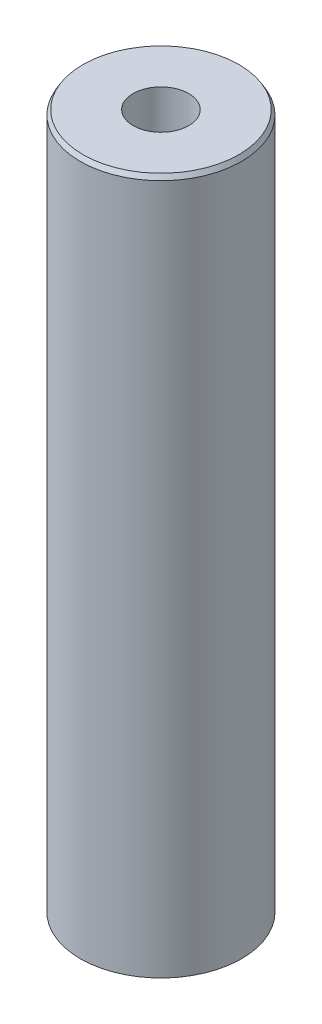
ISO-10303-21;
HEADER;
FILE_DESCRIPTION(('STEP AP214'),'2;1');
FILE_NAME('part.step','',(''),(''),'','','');
FILE_SCHEMA(('AUTOMOTIVE_DESIGN { 1 0 10303 214 1 1 1 1 }'));
ENDSEC;
DATA;
#1=APPLICATION_CONTEXT('core data for automotive mechanical design processes');
#2=APPLICATION_PROTOCOL_DEFINITION('international standard','automotive_design',2000,#1);
#3=PRODUCT_CONTEXT('',#1,'mechanical');
#4=PRODUCT('Part','Part','',(#3));
#5=PRODUCT_RELATED_PRODUCT_CATEGORY('part','',(#4));
#6=PRODUCT_DEFINITION_FORMATION('','',#4);
#7=PRODUCT_DEFINITION_CONTEXT('part definition',#1,'design');
#8=PRODUCT_DEFINITION('design','',#6,#7);
#9=PRODUCT_DEFINITION_SHAPE('','',#8);
#10=(LENGTH_UNIT() NAMED_UNIT(*) SI_UNIT(.MILLI.,.METRE.));
#11=(NAMED_UNIT(*) PLANE_ANGLE_UNIT() SI_UNIT($,.RADIAN.));
#12=(NAMED_UNIT(*) SI_UNIT($,.STERADIAN.) SOLID_ANGLE_UNIT());
#13=UNCERTAINTY_MEASURE_WITH_UNIT(LENGTH_MEASURE(1.E-05),#10,'distance_accuracy_value','');
#14=(GEOMETRIC_REPRESENTATION_CONTEXT(3) GLOBAL_UNCERTAINTY_ASSIGNED_CONTEXT((#13)) GLOBAL_UNIT_ASSIGNED_CONTEXT((#10,
#11,#12)) REPRESENTATION_CONTEXT('',''));
#15=CARTESIAN_POINT('',(0.,0.,0.));
#16=DIRECTION('',(0.,0.,1.));
#17=DIRECTION('',(1.,0.,0.));
#18=AXIS2_PLACEMENT_3D('',#15,#16,#17);
#19=CARTESIAN_POINT('',(0.,454.084616265986,0.));
#20=DIRECTION('',(0.,-1.,0.));
#21=DIRECTION('',(0.,0.,-1.));
#22=AXIS2_PLACEMENT_3D('',#19,#20,#21);
#23=CYLINDRICAL_SURFACE('',#22,52.5);
#24=CARTESIAN_POINT('',(0.,451.092102443926,0.));
#25=DIRECTION('',(0.,1.,0.));
#26=DIRECTION('',(0.,0.,1.));
#27=AXIS2_PLACEMENT_3D('',#24,#25,#26);
#28=CIRCLE('',#27,52.5);
#29=CARTESIAN_POINT('',(0.,451.092102443926,52.5));
#30=VERTEX_POINT('',#29);
#31=EDGE_CURVE('E50',#30,#30,#28,.F.);
#32=ORIENTED_EDGE('',*,*,#31,.T.);
#33=EDGE_LOOP('',(#32));
#34=FACE_BOUND('',#33,.T.);
#35=CARTESIAN_POINT('',(0.,1.7277286607198,0.));
#36=DIRECTION('',(0.,1.,0.));
#37=DIRECTION('',(0.,0.,1.));
#38=AXIS2_PLACEMENT_3D('',#35,#36,#37);
#39=CIRCLE('',#38,52.5);
#40=CARTESIAN_POINT('',(0.,1.7277286607198,52.5));
#41=VERTEX_POINT('',#40);
#42=EDGE_CURVE('E51',#41,#41,#39,.T.);
#43=ORIENTED_EDGE('',*,*,#42,.T.);
#44=EDGE_LOOP('',(#43));
#45=FACE_BOUND('',#44,.T.);
#46=ADVANCED_FACE('F39',(#34,#45),#23,.T.);
#47=CARTESIAN_POINT('',(0.,454.084616265986,0.));
#48=DIRECTION('',(0.,1.,0.));
#49=DIRECTION('',(0.,0.,1.));
#50=AXIS2_PLACEMENT_3D('',#47,#48,#49);
#51=PLANE('',#50);
#52=CARTESIAN_POINT('',(0.,454.084616265986,0.));
#53=DIRECTION('',(0.,1.,0.));
#54=DIRECTION('',(0.,0.,1.));
#55=AXIS2_PLACEMENT_3D('',#52,#53,#54);
#56=CIRCLE('',#55,50.7722713392802);
#57=CARTESIAN_POINT('',(0.,454.084616265986,50.7722713392802));
#58=VERTEX_POINT('',#57);
#59=EDGE_CURVE('E54',#58,#58,#56,.T.);
#60=ORIENTED_EDGE('',*,*,#59,.T.);
#61=EDGE_LOOP('',(#60));
#62=FACE_BOUND('',#61,.T.);
#63=CARTESIAN_POINT('',(0.,454.084616265986,0.));
#64=DIRECTION('',(0.,1.,0.));
#65=DIRECTION('',(0.,0.,1.));
#66=AXIS2_PLACEMENT_3D('',#63,#64,#65);
#67=CIRCLE('',#66,18.1011915810763);
#68=CARTESIAN_POINT('',(0.,454.084616265986,18.1011915810763));
#69=VERTEX_POINT('',#68);
#70=EDGE_CURVE('E58',#69,#69,#67,.T.);
#71=ORIENTED_EDGE('',*,*,#70,.F.);
#72=EDGE_LOOP('',(#71));
#73=FACE_BOUND('',#72,.T.);
#74=ADVANCED_FACE('F69',(#62,#73),#51,.T.);
#75=CARTESIAN_POINT('',(0.,0.,0.));
#76=DIRECTION('',(0.,1.,0.));
#77=DIRECTION('',(0.,0.,1.));
#78=AXIS2_PLACEMENT_3D('',#75,#76,#77);
#79=PLANE('',#78);
#80=CARTESIAN_POINT('',(0.,0.,0.));
#81=DIRECTION('',(0.,1.,0.));
#82=DIRECTION('',(0.,0.,1.));
#83=AXIS2_PLACEMENT_3D('',#80,#81,#82);
#84=CIRCLE('',#83,49.5074861779404);
#85=CARTESIAN_POINT('',(0.,0.,49.5074861779404));
#86=VERTEX_POINT('',#85);
#87=EDGE_CURVE('E10',#86,#86,#84,.F.);
#88=ORIENTED_EDGE('',*,*,#87,.T.);
#89=EDGE_LOOP('',(#88));
#90=FACE_BOUND('',#89,.T.);
#91=CARTESIAN_POINT('',(0.,0.,0.));
#92=DIRECTION('',(0.,1.,0.));
#93=DIRECTION('',(0.,0.,1.));
#94=AXIS2_PLACEMENT_3D('',#91,#92,#93);
#95=CIRCLE('',#94,18.1011915810763);
#96=CARTESIAN_POINT('',(0.,0.,18.1011915810763));
#97=VERTEX_POINT('',#96);
#98=EDGE_CURVE('E63',#97,#97,#95,.T.);
#99=ORIENTED_EDGE('',*,*,#98,.T.);
#100=EDGE_LOOP('',(#99));
#101=FACE_BOUND('',#100,.T.);
#102=ADVANCED_FACE('F75',(#90,#101),#79,.F.);
#103=CARTESIAN_POINT('',(0.,454.084616265986,0.));
#104=DIRECTION('',(0.,-1.,0.));
#105=DIRECTION('',(0.,0.,-1.));
#106=AXIS2_PLACEMENT_3D('',#103,#104,#105);
#107=CYLINDRICAL_SURFACE('',#106,18.1011915810763);
#108=ORIENTED_EDGE('',*,*,#70,.T.);
#109=EDGE_LOOP('',(#108));
#110=FACE_BOUND('',#109,.T.);
#111=ORIENTED_EDGE('',*,*,#98,.F.);
#112=EDGE_LOOP('',(#111));
#113=FACE_BOUND('',#112,.T.);
#114=ADVANCED_FACE('F70',(#110,#113),#107,.F.);
#115=CARTESIAN_POINT('',(0.,454.084616265986,0.));
#116=DIRECTION('',(0.,-1.,0.));
#117=DIRECTION('',(0.,0.,-1.));
#118=AXIS2_PLACEMENT_3D('',#115,#116,#117);
#119=CONICAL_SURFACE('',#118,50.7722713392802,0.523598775598308);
#120=ORIENTED_EDGE('',*,*,#31,.F.);
#121=EDGE_LOOP('',(#120));
#122=FACE_BOUND('',#121,.T.);
#123=ORIENTED_EDGE('',*,*,#59,.F.);
#124=EDGE_LOOP('',(#123));
#125=FACE_BOUND('',#124,.T.);
#126=ADVANCED_FACE('F81',(#122,#125),#119,.T.);
#127=CARTESIAN_POINT('',(0.,1.7277286607198,0.));
#128=DIRECTION('',(0.,1.,0.));
#129=DIRECTION('',(0.,0.,1.));
#130=AXIS2_PLACEMENT_3D('',#127,#128,#129);
#131=CONICAL_SURFACE('',#130,52.5,1.04719755119659);
#132=ORIENTED_EDGE('',*,*,#87,.F.);
#133=EDGE_LOOP('',(#132));
#134=FACE_BOUND('',#133,.T.);
#135=ORIENTED_EDGE('',*,*,#42,.F.);
#136=EDGE_LOOP('',(#135));
#137=FACE_BOUND('',#136,.T.);
#138=ADVANCED_FACE('F45',(#134,#137),#131,.T.);
#139=CLOSED_SHELL('',(#46,#74,#102,#114,#126,#138));
#140=MANIFOLD_SOLID_BREP('B2',#139);
#141=ADVANCED_BREP_SHAPE_REPRESENTATION('',(#18,#140),#14);
#142=SHAPE_DEFINITION_REPRESENTATION(#9,#141);
ENDSEC;
END-ISO-10303-21;
